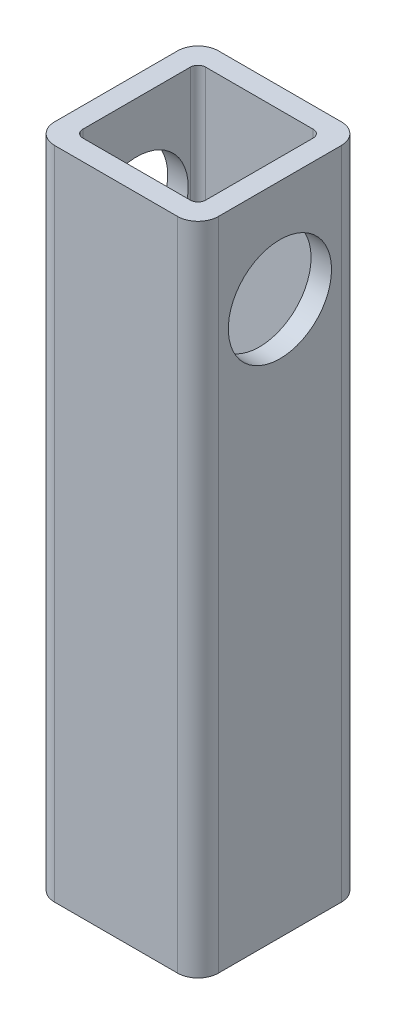
ISO-10303-21;
HEADER;
FILE_DESCRIPTION(('STEP AP214'),'2;1');
FILE_NAME('part.step','',(''),(''),'','','');
FILE_SCHEMA(('AUTOMOTIVE_DESIGN { 1 0 10303 214 1 1 1 1 }'));
ENDSEC;
DATA;
#1=APPLICATION_CONTEXT('core data for automotive mechanical design processes');
#2=APPLICATION_PROTOCOL_DEFINITION('international standard','automotive_design',2000,#1);
#3=PRODUCT_CONTEXT('',#1,'mechanical');
#4=PRODUCT('Part','Part','',(#3));
#5=PRODUCT_RELATED_PRODUCT_CATEGORY('part','',(#4));
#6=PRODUCT_DEFINITION_FORMATION('','',#4);
#7=PRODUCT_DEFINITION_CONTEXT('part definition',#1,'design');
#8=PRODUCT_DEFINITION('design','',#6,#7);
#9=PRODUCT_DEFINITION_SHAPE('','',#8);
#10=(LENGTH_UNIT() NAMED_UNIT(*) SI_UNIT(.MILLI.,.METRE.));
#11=(NAMED_UNIT(*) PLANE_ANGLE_UNIT() SI_UNIT($,.RADIAN.));
#12=(NAMED_UNIT(*) SI_UNIT($,.STERADIAN.) SOLID_ANGLE_UNIT());
#13=UNCERTAINTY_MEASURE_WITH_UNIT(LENGTH_MEASURE(1.E-05),#10,'distance_accuracy_value','');
#14=(GEOMETRIC_REPRESENTATION_CONTEXT(3) GLOBAL_UNCERTAINTY_ASSIGNED_CONTEXT((#13)) GLOBAL_UNIT_ASSIGNED_CONTEXT((#10,
#11,#12)) REPRESENTATION_CONTEXT('',''));
#15=CARTESIAN_POINT('',(0.,0.,0.));
#16=DIRECTION('',(0.,0.,1.));
#17=DIRECTION('',(1.,0.,0.));
#18=AXIS2_PLACEMENT_3D('',#15,#16,#17);
#19=CARTESIAN_POINT('',(19.05,101.6,19.05));
#20=DIRECTION('',(0.,1.,0.));
#21=DIRECTION('',(0.,0.,1.));
#22=AXIS2_PLACEMENT_3D('',#19,#20,#21);
#23=PLANE('',#22);
#24=CARTESIAN_POINT('',(19.05,101.6,19.05));
#25=DIRECTION('',(0.,1.,0.));
#26=DIRECTION('',(0.,0.,1.));
#27=AXIS2_PLACEMENT_3D('',#24,#25,#26);
#28=CIRCLE('',#27,6.35);
#29=CARTESIAN_POINT('',(19.05,101.6,25.4));
#30=VERTEX_POINT('',#29);
#31=CARTESIAN_POINT('',(25.4,101.6,19.05));
#32=VERTEX_POINT('',#31);
#33=EDGE_CURVE('E214',#30,#32,#28,.T.);
#34=ORIENTED_EDGE('',*,*,#33,.T.);
#35=DIRECTION('',(0.,0.,-1.));
#36=VECTOR('',#35,1.);
#37=CARTESIAN_POINT('',(25.4,101.6,19.05));
#38=LINE('',#37,#36);
#39=CARTESIAN_POINT('',(25.4,101.6,-19.05));
#40=VERTEX_POINT('',#39);
#41=EDGE_CURVE('E217',#32,#40,#38,.T.);
#42=ORIENTED_EDGE('',*,*,#41,.T.);
#43=CARTESIAN_POINT('',(19.05,101.6,-19.05));
#44=DIRECTION('',(0.,1.,0.));
#45=DIRECTION('',(0.,0.,1.));
#46=AXIS2_PLACEMENT_3D('',#43,#44,#45);
#47=CIRCLE('',#46,6.35);
#48=CARTESIAN_POINT('',(19.05,101.6,-25.4));
#49=VERTEX_POINT('',#48);
#50=EDGE_CURVE('E220',#40,#49,#47,.T.);
#51=ORIENTED_EDGE('',*,*,#50,.T.);
#52=DIRECTION('',(-1.,0.,0.));
#53=VECTOR('',#52,1.);
#54=CARTESIAN_POINT('',(-19.05,101.6,-25.4));
#55=LINE('',#54,#53);
#56=CARTESIAN_POINT('',(-19.05,101.6,-25.4));
#57=VERTEX_POINT('',#56);
#58=EDGE_CURVE('E222',#49,#57,#55,.T.);
#59=ORIENTED_EDGE('',*,*,#58,.T.);
#60=CARTESIAN_POINT('',(-19.05,101.6,-19.05));
#61=DIRECTION('',(0.,1.,0.));
#62=DIRECTION('',(0.,0.,1.));
#63=AXIS2_PLACEMENT_3D('',#60,#61,#62);
#64=CIRCLE('',#63,6.35);
#65=CARTESIAN_POINT('',(-25.4,101.6,-19.05));
#66=VERTEX_POINT('',#65);
#67=EDGE_CURVE('E224',#57,#66,#64,.T.);
#68=ORIENTED_EDGE('',*,*,#67,.T.);
#69=DIRECTION('',(0.,0.,1.));
#70=VECTOR('',#69,1.);
#71=CARTESIAN_POINT('',(-25.4,101.6,19.05));
#72=LINE('',#71,#70);
#73=CARTESIAN_POINT('',(-25.4,101.6,19.05));
#74=VERTEX_POINT('',#73);
#75=EDGE_CURVE('E226',#66,#74,#72,.T.);
#76=ORIENTED_EDGE('',*,*,#75,.T.);
#77=CARTESIAN_POINT('',(-19.05,101.6,19.05));
#78=DIRECTION('',(0.,1.,0.));
#79=DIRECTION('',(0.,0.,1.));
#80=AXIS2_PLACEMENT_3D('',#77,#78,#79);
#81=CIRCLE('',#80,6.35);
#82=CARTESIAN_POINT('',(-19.05,101.6,25.4));
#83=VERTEX_POINT('',#82);
#84=EDGE_CURVE('E228',#74,#83,#81,.T.);
#85=ORIENTED_EDGE('',*,*,#84,.T.);
#86=DIRECTION('',(1.,0.,0.));
#87=VECTOR('',#86,1.);
#88=CARTESIAN_POINT('',(-19.05,101.6,25.4));
#89=LINE('',#88,#87);
#90=EDGE_CURVE('E230',#83,#30,#89,.T.);
#91=ORIENTED_EDGE('',*,*,#90,.T.);
#92=EDGE_LOOP('',(#34,#42,#51,#59,#68,#76,#85,#91));
#93=FACE_BOUND('',#92,.T.);
#94=DIRECTION('',(0.,0.,-1.));
#95=VECTOR('',#94,1.);
#96=CARTESIAN_POINT('',(19.05,101.6,16.66875));
#97=LINE('',#96,#95);
#98=CARTESIAN_POINT('',(19.05,101.6,16.66875));
#99=VERTEX_POINT('',#98);
#100=CARTESIAN_POINT('',(19.05,101.6,-16.66875));
#101=VERTEX_POINT('',#100);
#102=EDGE_CURVE('E155',#99,#101,#97,.T.);
#103=ORIENTED_EDGE('',*,*,#102,.F.);
#104=CARTESIAN_POINT('',(16.66875,101.6,16.66875));
#105=DIRECTION('',(0.,1.,0.));
#106=DIRECTION('',(0.,0.,1.));
#107=AXIS2_PLACEMENT_3D('',#104,#105,#106);
#108=CIRCLE('',#107,2.38125);
#109=CARTESIAN_POINT('',(16.66875,101.6,19.05));
#110=VERTEX_POINT('',#109);
#111=EDGE_CURVE('E147',#110,#99,#108,.T.);
#112=ORIENTED_EDGE('',*,*,#111,.F.);
#113=DIRECTION('',(1.,0.,0.));
#114=VECTOR('',#113,1.);
#115=CARTESIAN_POINT('',(-16.66875,101.6,19.05));
#116=LINE('',#115,#114);
#117=CARTESIAN_POINT('',(-16.66875,101.6,19.05));
#118=VERTEX_POINT('',#117);
#119=EDGE_CURVE('E181',#118,#110,#116,.T.);
#120=ORIENTED_EDGE('',*,*,#119,.F.);
#121=CARTESIAN_POINT('',(-16.66875,101.6,16.66875));
#122=DIRECTION('',(0.,1.,0.));
#123=DIRECTION('',(0.,0.,1.));
#124=AXIS2_PLACEMENT_3D('',#121,#122,#123);
#125=CIRCLE('',#124,2.38125);
#126=CARTESIAN_POINT('',(-19.05,101.6,16.66875));
#127=VERTEX_POINT('',#126);
#128=EDGE_CURVE('E179',#127,#118,#125,.T.);
#129=ORIENTED_EDGE('',*,*,#128,.F.);
#130=DIRECTION('',(0.,0.,1.));
#131=VECTOR('',#130,1.);
#132=CARTESIAN_POINT('',(-19.05,101.6,16.66875));
#133=LINE('',#132,#131);
#134=CARTESIAN_POINT('',(-19.05,101.6,-16.66875));
#135=VERTEX_POINT('',#134);
#136=EDGE_CURVE('E177',#135,#127,#133,.T.);
#137=ORIENTED_EDGE('',*,*,#136,.F.);
#138=CARTESIAN_POINT('',(-16.66875,101.6,-16.66875));
#139=DIRECTION('',(0.,1.,0.));
#140=DIRECTION('',(0.,0.,1.));
#141=AXIS2_PLACEMENT_3D('',#138,#139,#140);
#142=CIRCLE('',#141,2.38125);
#143=CARTESIAN_POINT('',(-16.66875,101.6,-19.05));
#144=VERTEX_POINT('',#143);
#145=EDGE_CURVE('E175',#144,#135,#142,.T.);
#146=ORIENTED_EDGE('',*,*,#145,.F.);
#147=DIRECTION('',(-1.,0.,0.));
#148=VECTOR('',#147,1.);
#149=CARTESIAN_POINT('',(-16.66875,101.6,-19.05));
#150=LINE('',#149,#148);
#151=CARTESIAN_POINT('',(16.66875,101.6,-19.05));
#152=VERTEX_POINT('',#151);
#153=EDGE_CURVE('E170',#152,#144,#150,.T.);
#154=ORIENTED_EDGE('',*,*,#153,.F.);
#155=CARTESIAN_POINT('',(16.66875,101.6,-16.66875));
#156=DIRECTION('',(0.,1.,0.));
#157=DIRECTION('',(0.,0.,1.));
#158=AXIS2_PLACEMENT_3D('',#155,#156,#157);
#159=CIRCLE('',#158,2.38125);
#160=EDGE_CURVE('E168',#101,#152,#159,.T.);
#161=ORIENTED_EDGE('',*,*,#160,.F.);
#162=EDGE_LOOP('',(#103,#112,#120,#129,#137,#146,#154,#161));
#163=FACE_BOUND('',#162,.T.);
#164=ADVANCED_FACE('F33',(#93,#163),#23,.T.);
#165=CARTESIAN_POINT('',(19.05,-101.6,19.05));
#166=DIRECTION('',(0.,1.,0.));
#167=DIRECTION('',(0.,0.,1.));
#168=AXIS2_PLACEMENT_3D('',#165,#166,#167);
#169=PLANE('',#168);
#170=CARTESIAN_POINT('',(19.05,-101.6,19.05));
#171=DIRECTION('',(0.,1.,0.));
#172=DIRECTION('',(0.,0.,1.));
#173=AXIS2_PLACEMENT_3D('',#170,#171,#172);
#174=CIRCLE('',#173,6.35);
#175=CARTESIAN_POINT('',(19.05,-101.6,25.4));
#176=VERTEX_POINT('',#175);
#177=CARTESIAN_POINT('',(25.4,-101.6,19.05));
#178=VERTEX_POINT('',#177);
#179=EDGE_CURVE('E163',#176,#178,#174,.T.);
#180=ORIENTED_EDGE('',*,*,#179,.F.);
#181=DIRECTION('',(1.,0.,0.));
#182=VECTOR('',#181,1.);
#183=CARTESIAN_POINT('',(-19.05,-101.6,25.4));
#184=LINE('',#183,#182);
#185=CARTESIAN_POINT('',(-19.05,-101.6,25.4));
#186=VERTEX_POINT('',#185);
#187=EDGE_CURVE('E218',#186,#176,#184,.T.);
#188=ORIENTED_EDGE('',*,*,#187,.F.);
#189=CARTESIAN_POINT('',(-19.05,-101.6,19.05));
#190=DIRECTION('',(0.,1.,0.));
#191=DIRECTION('',(0.,0.,1.));
#192=AXIS2_PLACEMENT_3D('',#189,#190,#191);
#193=CIRCLE('',#192,6.35);
#194=CARTESIAN_POINT('',(-25.4,-101.6,19.05));
#195=VERTEX_POINT('',#194);
#196=EDGE_CURVE('E245',#195,#186,#193,.T.);
#197=ORIENTED_EDGE('',*,*,#196,.F.);
#198=DIRECTION('',(0.,0.,1.));
#199=VECTOR('',#198,1.);
#200=CARTESIAN_POINT('',(-25.4,-101.6,19.05));
#201=LINE('',#200,#199);
#202=CARTESIAN_POINT('',(-25.4,-101.6,-19.05));
#203=VERTEX_POINT('',#202);
#204=EDGE_CURVE('E243',#203,#195,#201,.T.);
#205=ORIENTED_EDGE('',*,*,#204,.F.);
#206=CARTESIAN_POINT('',(-19.05,-101.6,-19.05));
#207=DIRECTION('',(0.,1.,0.));
#208=DIRECTION('',(0.,0.,1.));
#209=AXIS2_PLACEMENT_3D('',#206,#207,#208);
#210=CIRCLE('',#209,6.35);
#211=CARTESIAN_POINT('',(-19.05,-101.6,-25.4));
#212=VERTEX_POINT('',#211);
#213=EDGE_CURVE('E241',#212,#203,#210,.T.);
#214=ORIENTED_EDGE('',*,*,#213,.F.);
#215=DIRECTION('',(-1.,0.,0.));
#216=VECTOR('',#215,1.);
#217=CARTESIAN_POINT('',(-19.05,-101.6,-25.4));
#218=LINE('',#217,#216);
#219=CARTESIAN_POINT('',(19.05,-101.6,-25.4));
#220=VERTEX_POINT('',#219);
#221=EDGE_CURVE('E239',#220,#212,#218,.T.);
#222=ORIENTED_EDGE('',*,*,#221,.F.);
#223=CARTESIAN_POINT('',(19.05,-101.6,-19.05));
#224=DIRECTION('',(0.,1.,0.));
#225=DIRECTION('',(0.,0.,1.));
#226=AXIS2_PLACEMENT_3D('',#223,#224,#225);
#227=CIRCLE('',#226,6.35);
#228=CARTESIAN_POINT('',(25.4,-101.6,-19.05));
#229=VERTEX_POINT('',#228);
#230=EDGE_CURVE('E237',#229,#220,#227,.T.);
#231=ORIENTED_EDGE('',*,*,#230,.F.);
#232=DIRECTION('',(0.,0.,-1.));
#233=VECTOR('',#232,1.);
#234=CARTESIAN_POINT('',(25.4,-101.6,19.05));
#235=LINE('',#234,#233);
#236=EDGE_CURVE('E235',#178,#229,#235,.T.);
#237=ORIENTED_EDGE('',*,*,#236,.F.);
#238=EDGE_LOOP('',(#180,#188,#197,#205,#214,#222,#231,#237));
#239=FACE_BOUND('',#238,.T.);
#240=CARTESIAN_POINT('',(16.66875,-101.6,16.66875));
#241=DIRECTION('',(0.,1.,0.));
#242=DIRECTION('',(0.,0.,1.));
#243=AXIS2_PLACEMENT_3D('',#240,#241,#242);
#244=CIRCLE('',#243,2.38125);
#245=CARTESIAN_POINT('',(16.66875,-101.6,19.05));
#246=VERTEX_POINT('',#245);
#247=CARTESIAN_POINT('',(19.05,-101.6,16.66875));
#248=VERTEX_POINT('',#247);
#249=EDGE_CURVE('E57',#246,#248,#244,.T.);
#250=ORIENTED_EDGE('',*,*,#249,.T.);
#251=DIRECTION('',(0.,0.,-1.));
#252=VECTOR('',#251,1.);
#253=CARTESIAN_POINT('',(19.05,-101.6,16.66875));
#254=LINE('',#253,#252);
#255=CARTESIAN_POINT('',(19.05,-101.6,-16.66875));
#256=VERTEX_POINT('',#255);
#257=EDGE_CURVE('E162',#248,#256,#254,.T.);
#258=ORIENTED_EDGE('',*,*,#257,.T.);
#259=CARTESIAN_POINT('',(16.66875,-101.6,-16.66875));
#260=DIRECTION('',(0.,1.,0.));
#261=DIRECTION('',(0.,0.,1.));
#262=AXIS2_PLACEMENT_3D('',#259,#260,#261);
#263=CIRCLE('',#262,2.38125);
#264=CARTESIAN_POINT('',(16.66875,-101.6,-19.05));
#265=VERTEX_POINT('',#264);
#266=EDGE_CURVE('E186',#256,#265,#263,.T.);
#267=ORIENTED_EDGE('',*,*,#266,.T.);
#268=DIRECTION('',(-1.,0.,0.));
#269=VECTOR('',#268,1.);
#270=CARTESIAN_POINT('',(-16.66875,-101.6,-19.05));
#271=LINE('',#270,#269);
#272=CARTESIAN_POINT('',(-16.66875,-101.6,-19.05));
#273=VERTEX_POINT('',#272);
#274=EDGE_CURVE('E189',#265,#273,#271,.T.);
#275=ORIENTED_EDGE('',*,*,#274,.T.);
#276=CARTESIAN_POINT('',(-16.66875,-101.6,-16.66875));
#277=DIRECTION('',(0.,1.,0.));
#278=DIRECTION('',(0.,0.,1.));
#279=AXIS2_PLACEMENT_3D('',#276,#277,#278);
#280=CIRCLE('',#279,2.38125);
#281=CARTESIAN_POINT('',(-19.05,-101.6,-16.66875));
#282=VERTEX_POINT('',#281);
#283=EDGE_CURVE('E192',#273,#282,#280,.T.);
#284=ORIENTED_EDGE('',*,*,#283,.T.);
#285=DIRECTION('',(0.,0.,1.));
#286=VECTOR('',#285,1.);
#287=CARTESIAN_POINT('',(-19.05,-101.6,16.66875));
#288=LINE('',#287,#286);
#289=CARTESIAN_POINT('',(-19.05,-101.6,16.66875));
#290=VERTEX_POINT('',#289);
#291=EDGE_CURVE('E195',#282,#290,#288,.T.);
#292=ORIENTED_EDGE('',*,*,#291,.T.);
#293=CARTESIAN_POINT('',(-16.66875,-101.6,16.66875));
#294=DIRECTION('',(0.,1.,0.));
#295=DIRECTION('',(0.,0.,1.));
#296=AXIS2_PLACEMENT_3D('',#293,#294,#295);
#297=CIRCLE('',#296,2.38125);
#298=CARTESIAN_POINT('',(-16.66875,-101.6,19.05));
#299=VERTEX_POINT('',#298);
#300=EDGE_CURVE('E198',#290,#299,#297,.T.);
#301=ORIENTED_EDGE('',*,*,#300,.T.);
#302=DIRECTION('',(1.,0.,0.));
#303=VECTOR('',#302,1.);
#304=CARTESIAN_POINT('',(-16.66875,-101.6,19.05));
#305=LINE('',#304,#303);
#306=EDGE_CURVE('E156',#299,#246,#305,.T.);
#307=ORIENTED_EDGE('',*,*,#306,.T.);
#308=EDGE_LOOP('',(#250,#258,#267,#275,#284,#292,#301,#307));
#309=FACE_BOUND('',#308,.T.);
#310=ADVANCED_FACE('F276',(#239,#309),#169,.F.);
#311=CARTESIAN_POINT('',(19.05,101.6,19.05));
#312=DIRECTION('',(0.,-1.,0.));
#313=DIRECTION('',(0.,0.,-1.));
#314=AXIS2_PLACEMENT_3D('',#311,#312,#313);
#315=CYLINDRICAL_SURFACE('',#314,6.35);
#316=ORIENTED_EDGE('',*,*,#179,.T.);
#317=DIRECTION('',(0.,-1.,0.));
#318=VECTOR('',#317,1.);
#319=CARTESIAN_POINT('',(25.4,101.6,19.05));
#320=LINE('',#319,#318);
#321=EDGE_CURVE('E11',#32,#178,#320,.T.);
#322=ORIENTED_EDGE('',*,*,#321,.F.);
#323=ORIENTED_EDGE('',*,*,#33,.F.);
#324=DIRECTION('',(0.,-1.,0.));
#325=VECTOR('',#324,1.);
#326=CARTESIAN_POINT('',(19.05,101.6,25.4));
#327=LINE('',#326,#325);
#328=EDGE_CURVE('E232',#30,#176,#327,.T.);
#329=ORIENTED_EDGE('',*,*,#328,.T.);
#330=EDGE_LOOP('',(#316,#322,#323,#329));
#331=FACE_BOUND('',#330,.T.);
#332=ADVANCED_FACE('F35',(#331),#315,.T.);
#333=CARTESIAN_POINT('',(25.4,101.6,19.05));
#334=DIRECTION('',(-1.,0.,0.));
#335=DIRECTION('',(0.,0.,1.));
#336=AXIS2_PLACEMENT_3D('',#333,#334,#335);
#337=PLANE('',#336);
#338=CARTESIAN_POINT('',(25.4,69.85,0.));
#339=DIRECTION('',(1.,0.,0.));
#340=DIRECTION('',(0.,0.,-1.));
#341=AXIS2_PLACEMENT_3D('',#338,#339,#340);
#342=CIRCLE('',#341,16.002);
#343=CARTESIAN_POINT('',(25.4,69.85,-16.002));
#344=VERTEX_POINT('',#343);
#345=EDGE_CURVE('E374',#344,#344,#342,.T.);
#346=ORIENTED_EDGE('',*,*,#345,.F.);
#347=EDGE_LOOP('',(#346));
#348=FACE_BOUND('',#347,.T.);
#349=ORIENTED_EDGE('',*,*,#236,.T.);
#350=DIRECTION('',(0.,-1.,0.));
#351=VECTOR('',#350,1.);
#352=CARTESIAN_POINT('',(25.4,101.6,-19.05));
#353=LINE('',#352,#351);
#354=EDGE_CURVE('E42',#40,#229,#353,.T.);
#355=ORIENTED_EDGE('',*,*,#354,.F.);
#356=ORIENTED_EDGE('',*,*,#41,.F.);
#357=ORIENTED_EDGE('',*,*,#321,.T.);
#358=EDGE_LOOP('',(#349,#355,#356,#357));
#359=FACE_BOUND('',#358,.T.);
#360=ADVANCED_FACE('F293',(#348,#359),#337,.F.);
#361=CARTESIAN_POINT('',(19.05,101.6,-19.05));
#362=DIRECTION('',(0.,-1.,0.));
#363=DIRECTION('',(0.,0.,-1.));
#364=AXIS2_PLACEMENT_3D('',#361,#362,#363);
#365=CYLINDRICAL_SURFACE('',#364,6.35);
#366=ORIENTED_EDGE('',*,*,#230,.T.);
#367=DIRECTION('',(0.,-1.,0.));
#368=VECTOR('',#367,1.);
#369=CARTESIAN_POINT('',(19.05,101.6,-25.4));
#370=LINE('',#369,#368);
#371=EDGE_CURVE('E262',#49,#220,#370,.T.);
#372=ORIENTED_EDGE('',*,*,#371,.F.);
#373=ORIENTED_EDGE('',*,*,#50,.F.);
#374=ORIENTED_EDGE('',*,*,#354,.T.);
#375=EDGE_LOOP('',(#366,#372,#373,#374));
#376=FACE_BOUND('',#375,.T.);
#377=ADVANCED_FACE('F270',(#376),#365,.T.);
#378=CARTESIAN_POINT('',(-19.05,101.6,-25.4));
#379=DIRECTION('',(0.,0.,1.));
#380=DIRECTION('',(1.,0.,0.));
#381=AXIS2_PLACEMENT_3D('',#378,#379,#380);
#382=PLANE('',#381);
#383=ORIENTED_EDGE('',*,*,#221,.T.);
#384=DIRECTION('',(0.,-1.,0.));
#385=VECTOR('',#384,1.);
#386=CARTESIAN_POINT('',(-19.05,101.6,-25.4));
#387=LINE('',#386,#385);
#388=EDGE_CURVE('E259',#57,#212,#387,.T.);
#389=ORIENTED_EDGE('',*,*,#388,.F.);
#390=ORIENTED_EDGE('',*,*,#58,.F.);
#391=ORIENTED_EDGE('',*,*,#371,.T.);
#392=EDGE_LOOP('',(#383,#389,#390,#391));
#393=FACE_BOUND('',#392,.T.);
#394=ADVANCED_FACE('F282',(#393),#382,.F.);
#395=CARTESIAN_POINT('',(-19.05,101.6,-19.05));
#396=DIRECTION('',(0.,-1.,0.));
#397=DIRECTION('',(0.,0.,-1.));
#398=AXIS2_PLACEMENT_3D('',#395,#396,#397);
#399=CYLINDRICAL_SURFACE('',#398,6.35);
#400=ORIENTED_EDGE('',*,*,#213,.T.);
#401=DIRECTION('',(0.,-1.,0.));
#402=VECTOR('',#401,1.);
#403=CARTESIAN_POINT('',(-25.4,101.6,-19.05));
#404=LINE('',#403,#402);
#405=EDGE_CURVE('E256',#66,#203,#404,.T.);
#406=ORIENTED_EDGE('',*,*,#405,.F.);
#407=ORIENTED_EDGE('',*,*,#67,.F.);
#408=ORIENTED_EDGE('',*,*,#388,.T.);
#409=EDGE_LOOP('',(#400,#406,#407,#408));
#410=FACE_BOUND('',#409,.T.);
#411=ADVANCED_FACE('F286',(#410),#399,.T.);
#412=CARTESIAN_POINT('',(-25.4,101.6,19.05));
#413=DIRECTION('',(1.,0.,0.));
#414=DIRECTION('',(0.,0.,-1.));
#415=AXIS2_PLACEMENT_3D('',#412,#413,#414);
#416=PLANE('',#415);
#417=CARTESIAN_POINT('',(-25.4,69.85,0.));
#418=DIRECTION('',(1.,0.,0.));
#419=DIRECTION('',(0.,0.,-1.));
#420=AXIS2_PLACEMENT_3D('',#417,#418,#419);
#421=CIRCLE('',#420,16.002);
#422=CARTESIAN_POINT('',(-25.4,69.85,-16.002));
#423=VERTEX_POINT('',#422);
#424=EDGE_CURVE('E373',#423,#423,#421,.T.);
#425=ORIENTED_EDGE('',*,*,#424,.T.);
#426=EDGE_LOOP('',(#425));
#427=FACE_BOUND('',#426,.T.);
#428=ORIENTED_EDGE('',*,*,#204,.T.);
#429=DIRECTION('',(0.,-1.,0.));
#430=VECTOR('',#429,1.);
#431=CARTESIAN_POINT('',(-25.4,101.6,19.05));
#432=LINE('',#431,#430);
#433=EDGE_CURVE('E253',#74,#195,#432,.T.);
#434=ORIENTED_EDGE('',*,*,#433,.F.);
#435=ORIENTED_EDGE('',*,*,#75,.F.);
#436=ORIENTED_EDGE('',*,*,#405,.T.);
#437=EDGE_LOOP('',(#428,#434,#435,#436));
#438=FACE_BOUND('',#437,.T.);
#439=ADVANCED_FACE('F306',(#427,#438),#416,.F.);
#440=CARTESIAN_POINT('',(-19.05,101.6,19.05));
#441=DIRECTION('',(0.,-1.,0.));
#442=DIRECTION('',(0.,0.,-1.));
#443=AXIS2_PLACEMENT_3D('',#440,#441,#442);
#444=CYLINDRICAL_SURFACE('',#443,6.35);
#445=ORIENTED_EDGE('',*,*,#196,.T.);
#446=DIRECTION('',(0.,-1.,0.));
#447=VECTOR('',#446,1.);
#448=CARTESIAN_POINT('',(-19.05,101.6,25.4));
#449=LINE('',#448,#447);
#450=EDGE_CURVE('E250',#83,#186,#449,.T.);
#451=ORIENTED_EDGE('',*,*,#450,.F.);
#452=ORIENTED_EDGE('',*,*,#84,.F.);
#453=ORIENTED_EDGE('',*,*,#433,.T.);
#454=EDGE_LOOP('',(#445,#451,#452,#453));
#455=FACE_BOUND('',#454,.T.);
#456=ADVANCED_FACE('F304',(#455),#444,.T.);
#457=CARTESIAN_POINT('',(-19.05,101.6,25.4));
#458=DIRECTION('',(0.,0.,-1.));
#459=DIRECTION('',(-1.,0.,0.));
#460=AXIS2_PLACEMENT_3D('',#457,#458,#459);
#461=PLANE('',#460);
#462=ORIENTED_EDGE('',*,*,#187,.T.);
#463=ORIENTED_EDGE('',*,*,#328,.F.);
#464=ORIENTED_EDGE('',*,*,#90,.F.);
#465=ORIENTED_EDGE('',*,*,#450,.T.);
#466=EDGE_LOOP('',(#462,#463,#464,#465));
#467=FACE_BOUND('',#466,.T.);
#468=ADVANCED_FACE('F299',(#467),#461,.F.);
#469=CARTESIAN_POINT('',(16.66875,101.6,16.66875));
#470=DIRECTION('',(0.,-1.,0.));
#471=DIRECTION('',(0.,0.,-1.));
#472=AXIS2_PLACEMENT_3D('',#469,#470,#471);
#473=CYLINDRICAL_SURFACE('',#472,2.38125);
#474=ORIENTED_EDGE('',*,*,#249,.F.);
#475=DIRECTION('',(0.,-1.,0.));
#476=VECTOR('',#475,1.);
#477=CARTESIAN_POINT('',(16.66875,101.6,19.05));
#478=LINE('',#477,#476);
#479=EDGE_CURVE('E151',#110,#246,#478,.T.);
#480=ORIENTED_EDGE('',*,*,#479,.F.);
#481=ORIENTED_EDGE('',*,*,#111,.T.);
#482=DIRECTION('',(0.,-1.,0.));
#483=VECTOR('',#482,1.);
#484=CARTESIAN_POINT('',(19.05,101.6,16.66875));
#485=LINE('',#484,#483);
#486=EDGE_CURVE('E150',#99,#248,#485,.T.);
#487=ORIENTED_EDGE('',*,*,#486,.T.);
#488=EDGE_LOOP('',(#474,#480,#481,#487));
#489=FACE_BOUND('',#488,.T.);
#490=ADVANCED_FACE('F149',(#489),#473,.F.);
#491=CARTESIAN_POINT('',(19.05,101.6,16.66875));
#492=DIRECTION('',(-1.,0.,0.));
#493=DIRECTION('',(0.,0.,1.));
#494=AXIS2_PLACEMENT_3D('',#491,#492,#493);
#495=PLANE('',#494);
#496=CARTESIAN_POINT('',(19.05,69.85,0.));
#497=DIRECTION('',(-1.,0.,0.));
#498=DIRECTION('',(0.,0.,1.));
#499=AXIS2_PLACEMENT_3D('',#496,#497,#498);
#500=CIRCLE('',#499,16.002);
#501=CARTESIAN_POINT('',(19.05,69.85,16.002));
#502=VERTEX_POINT('',#501);
#503=EDGE_CURVE('E184',#502,#502,#500,.T.);
#504=ORIENTED_EDGE('',*,*,#503,.F.);
#505=EDGE_LOOP('',(#504));
#506=FACE_BOUND('',#505,.T.);
#507=ORIENTED_EDGE('',*,*,#257,.F.);
#508=ORIENTED_EDGE('',*,*,#486,.F.);
#509=ORIENTED_EDGE('',*,*,#102,.T.);
#510=DIRECTION('',(0.,-1.,0.));
#511=VECTOR('',#510,1.);
#512=CARTESIAN_POINT('',(19.05,101.6,-16.66875));
#513=LINE('',#512,#511);
#514=EDGE_CURVE('E164',#101,#256,#513,.T.);
#515=ORIENTED_EDGE('',*,*,#514,.T.);
#516=EDGE_LOOP('',(#507,#508,#509,#515));
#517=FACE_BOUND('',#516,.T.);
#518=ADVANCED_FACE('F159',(#506,#517),#495,.T.);
#519=CARTESIAN_POINT('',(16.66875,101.6,-16.66875));
#520=DIRECTION('',(0.,-1.,0.));
#521=DIRECTION('',(0.,0.,-1.));
#522=AXIS2_PLACEMENT_3D('',#519,#520,#521);
#523=CYLINDRICAL_SURFACE('',#522,2.38125);
#524=ORIENTED_EDGE('',*,*,#266,.F.);
#525=ORIENTED_EDGE('',*,*,#514,.F.);
#526=ORIENTED_EDGE('',*,*,#160,.T.);
#527=DIRECTION('',(0.,-1.,0.));
#528=VECTOR('',#527,1.);
#529=CARTESIAN_POINT('',(16.66875,101.6,-19.05));
#530=LINE('',#529,#528);
#531=EDGE_CURVE('E211',#152,#265,#530,.T.);
#532=ORIENTED_EDGE('',*,*,#531,.T.);
#533=EDGE_LOOP('',(#524,#525,#526,#532));
#534=FACE_BOUND('',#533,.T.);
#535=ADVANCED_FACE('F333',(#534),#523,.F.);
#536=CARTESIAN_POINT('',(-16.66875,101.6,-19.05));
#537=DIRECTION('',(0.,0.,1.));
#538=DIRECTION('',(1.,0.,0.));
#539=AXIS2_PLACEMENT_3D('',#536,#537,#538);
#540=PLANE('',#539);
#541=ORIENTED_EDGE('',*,*,#274,.F.);
#542=ORIENTED_EDGE('',*,*,#531,.F.);
#543=ORIENTED_EDGE('',*,*,#153,.T.);
#544=DIRECTION('',(0.,-1.,0.));
#545=VECTOR('',#544,1.);
#546=CARTESIAN_POINT('',(-16.66875,101.6,-19.05));
#547=LINE('',#546,#545);
#548=EDGE_CURVE('E209',#144,#273,#547,.T.);
#549=ORIENTED_EDGE('',*,*,#548,.T.);
#550=EDGE_LOOP('',(#541,#542,#543,#549));
#551=FACE_BOUND('',#550,.T.);
#552=ADVANCED_FACE('F338',(#551),#540,.T.);
#553=CARTESIAN_POINT('',(-16.66875,101.6,-16.66875));
#554=DIRECTION('',(0.,-1.,0.));
#555=DIRECTION('',(0.,0.,-1.));
#556=AXIS2_PLACEMENT_3D('',#553,#554,#555);
#557=CYLINDRICAL_SURFACE('',#556,2.38125);
#558=ORIENTED_EDGE('',*,*,#283,.F.);
#559=ORIENTED_EDGE('',*,*,#548,.F.);
#560=ORIENTED_EDGE('',*,*,#145,.T.);
#561=DIRECTION('',(0.,-1.,0.));
#562=VECTOR('',#561,1.);
#563=CARTESIAN_POINT('',(-19.05,101.6,-16.66875));
#564=LINE('',#563,#562);
#565=EDGE_CURVE('E207',#135,#282,#564,.T.);
#566=ORIENTED_EDGE('',*,*,#565,.T.);
#567=EDGE_LOOP('',(#558,#559,#560,#566));
#568=FACE_BOUND('',#567,.T.);
#569=ADVANCED_FACE('F345',(#568),#557,.F.);
#570=CARTESIAN_POINT('',(-19.05,101.6,16.66875));
#571=DIRECTION('',(1.,0.,0.));
#572=DIRECTION('',(0.,0.,-1.));
#573=AXIS2_PLACEMENT_3D('',#570,#571,#572);
#574=PLANE('',#573);
#575=CARTESIAN_POINT('',(-19.05,69.85,0.));
#576=DIRECTION('',(1.,0.,0.));
#577=DIRECTION('',(0.,0.,-1.));
#578=AXIS2_PLACEMENT_3D('',#575,#576,#577);
#579=CIRCLE('',#578,16.002);
#580=CARTESIAN_POINT('',(-19.05,69.85,-16.002));
#581=VERTEX_POINT('',#580);
#582=EDGE_CURVE('E37',#581,#581,#579,.T.);
#583=ORIENTED_EDGE('',*,*,#582,.F.);
#584=EDGE_LOOP('',(#583));
#585=FACE_BOUND('',#584,.T.);
#586=ORIENTED_EDGE('',*,*,#291,.F.);
#587=ORIENTED_EDGE('',*,*,#565,.F.);
#588=ORIENTED_EDGE('',*,*,#136,.T.);
#589=DIRECTION('',(0.,-1.,0.));
#590=VECTOR('',#589,1.);
#591=CARTESIAN_POINT('',(-19.05,101.6,16.66875));
#592=LINE('',#591,#590);
#593=EDGE_CURVE('E205',#127,#290,#592,.T.);
#594=ORIENTED_EDGE('',*,*,#593,.T.);
#595=EDGE_LOOP('',(#586,#587,#588,#594));
#596=FACE_BOUND('',#595,.T.);
#597=ADVANCED_FACE('F349',(#585,#596),#574,.T.);
#598=CARTESIAN_POINT('',(-16.66875,101.6,16.66875));
#599=DIRECTION('',(0.,-1.,0.));
#600=DIRECTION('',(0.,0.,-1.));
#601=AXIS2_PLACEMENT_3D('',#598,#599,#600);
#602=CYLINDRICAL_SURFACE('',#601,2.38125);
#603=ORIENTED_EDGE('',*,*,#300,.F.);
#604=ORIENTED_EDGE('',*,*,#593,.F.);
#605=ORIENTED_EDGE('',*,*,#128,.T.);
#606=DIRECTION('',(0.,-1.,0.));
#607=VECTOR('',#606,1.);
#608=CARTESIAN_POINT('',(-16.66875,101.6,19.05));
#609=LINE('',#608,#607);
#610=EDGE_CURVE('E49',#118,#299,#609,.T.);
#611=ORIENTED_EDGE('',*,*,#610,.T.);
#612=EDGE_LOOP('',(#603,#604,#605,#611));
#613=FACE_BOUND('',#612,.T.);
#614=ADVANCED_FACE('F353',(#613),#602,.F.);
#615=CARTESIAN_POINT('',(-16.66875,101.6,19.05));
#616=DIRECTION('',(0.,0.,-1.));
#617=DIRECTION('',(-1.,0.,0.));
#618=AXIS2_PLACEMENT_3D('',#615,#616,#617);
#619=PLANE('',#618);
#620=ORIENTED_EDGE('',*,*,#306,.F.);
#621=ORIENTED_EDGE('',*,*,#610,.F.);
#622=ORIENTED_EDGE('',*,*,#119,.T.);
#623=ORIENTED_EDGE('',*,*,#479,.T.);
#624=EDGE_LOOP('',(#620,#621,#622,#623));
#625=FACE_BOUND('',#624,.T.);
#626=ADVANCED_FACE('F357',(#625),#619,.T.);
#627=CARTESIAN_POINT('',(-25.4,69.85,0.));
#628=DIRECTION('',(1.,0.,0.));
#629=DIRECTION('',(0.,0.,-1.));
#630=AXIS2_PLACEMENT_3D('',#627,#628,#629);
#631=CYLINDRICAL_SURFACE('',#630,16.002);
#632=ORIENTED_EDGE('',*,*,#582,.T.);
#633=EDGE_LOOP('',(#632));
#634=FACE_BOUND('',#633,.T.);
#635=ORIENTED_EDGE('',*,*,#424,.F.);
#636=EDGE_LOOP('',(#635));
#637=FACE_BOUND('',#636,.T.);
#638=ADVANCED_FACE('F361',(#634,#637),#631,.F.);
#639=ORIENTED_EDGE('',*,*,#503,.T.);
#640=EDGE_LOOP('',(#639));
#641=FACE_BOUND('',#640,.T.);
#642=ORIENTED_EDGE('',*,*,#345,.T.);
#643=EDGE_LOOP('',(#642));
#644=FACE_BOUND('',#643,.T.);
#645=ADVANCED_FACE('F363',(#641,#644),#631,.F.);
#646=CLOSED_SHELL('',(#164,#310,#332,#360,#377,#394,#411,#439,#456,#468,#490,#518,#535,#552,
#569,#597,#614,#626,#638,#645));
#647=MANIFOLD_SOLID_BREP('B2',#646);
#648=ADVANCED_BREP_SHAPE_REPRESENTATION('',(#18,#647),#14);
#649=SHAPE_DEFINITION_REPRESENTATION(#9,#648);
ENDSEC;
END-ISO-10303-21;
